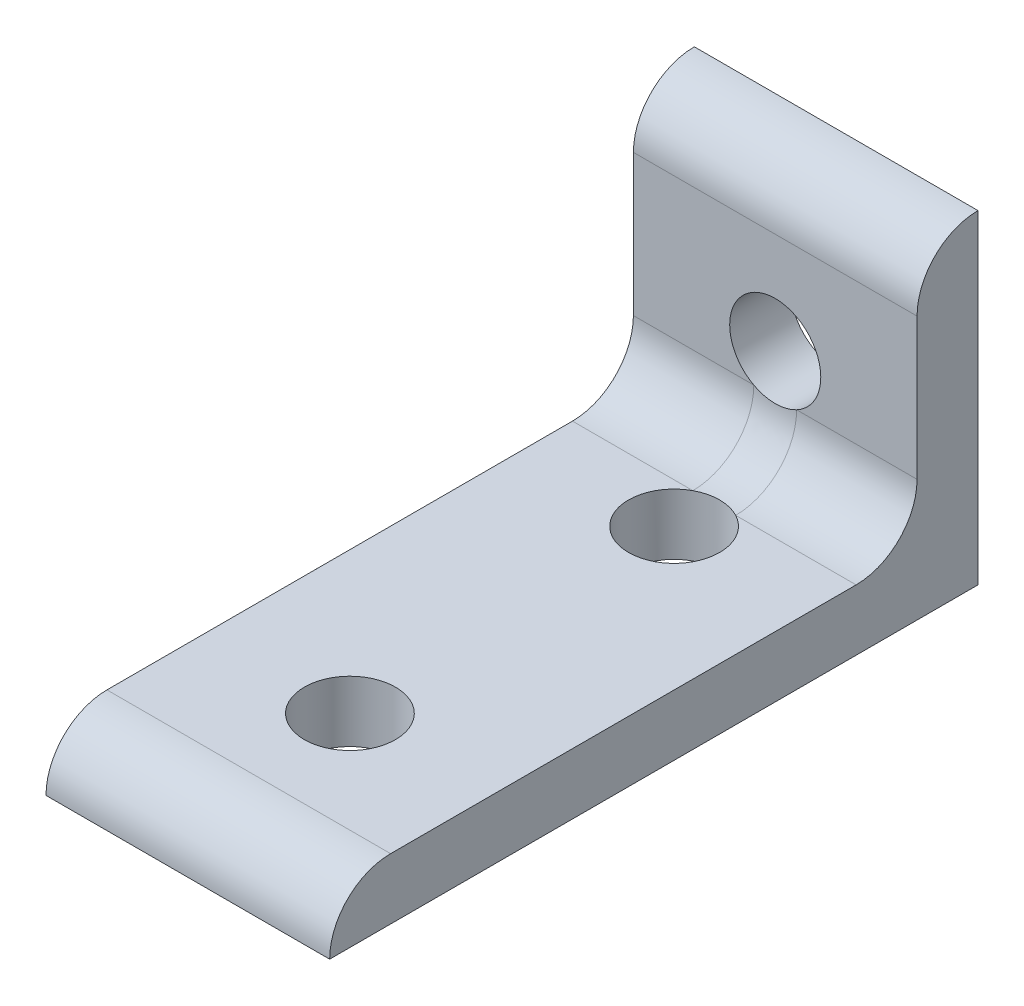
ISO-10303-21;
HEADER;
FILE_DESCRIPTION(('STEP AP214'),'2;1');
FILE_NAME('part.step','',(''),(''),'','','');
FILE_SCHEMA(('AUTOMOTIVE_DESIGN { 1 0 10303 214 1 1 1 1 }'));
ENDSEC;
DATA;
#1=APPLICATION_CONTEXT('core data for automotive mechanical design processes');
#2=APPLICATION_PROTOCOL_DEFINITION('international standard','automotive_design',2000,#1);
#3=PRODUCT_CONTEXT('',#1,'mechanical');
#4=PRODUCT('Part','Part','',(#3));
#5=PRODUCT_RELATED_PRODUCT_CATEGORY('part','',(#4));
#6=PRODUCT_DEFINITION_FORMATION('','',#4);
#7=PRODUCT_DEFINITION_CONTEXT('part definition',#1,'design');
#8=PRODUCT_DEFINITION('design','',#6,#7);
#9=PRODUCT_DEFINITION_SHAPE('','',#8);
#10=(LENGTH_UNIT() NAMED_UNIT(*) SI_UNIT(.MILLI.,.METRE.));
#11=(NAMED_UNIT(*) PLANE_ANGLE_UNIT() SI_UNIT($,.RADIAN.));
#12=(NAMED_UNIT(*) SI_UNIT($,.STERADIAN.) SOLID_ANGLE_UNIT());
#13=UNCERTAINTY_MEASURE_WITH_UNIT(LENGTH_MEASURE(1.E-05),#10,'distance_accuracy_value','');
#14=(GEOMETRIC_REPRESENTATION_CONTEXT(3) GLOBAL_UNCERTAINTY_ASSIGNED_CONTEXT((#13)) GLOBAL_UNIT_ASSIGNED_CONTEXT((#10,
#11,#12)) REPRESENTATION_CONTEXT('',''));
#15=CARTESIAN_POINT('',(0.,0.,0.));
#16=DIRECTION('',(0.,0.,1.));
#17=DIRECTION('',(1.,0.,0.));
#18=AXIS2_PLACEMENT_3D('',#15,#16,#17);
#19=CARTESIAN_POINT('',(22.225,21.8976746849943,23.4239638029782));
#20=DIRECTION('',(1.,0.,0.));
#21=DIRECTION('',(0.,0.,-1.));
#22=AXIS2_PLACEMENT_3D('',#19,#20,#21);
#23=PLANE('',#22);
#24=DIRECTION('',(0.,-1.,0.));
#25=VECTOR('',#24,1.);
#26=CARTESIAN_POINT('',(22.225,72.6976746849943,-22.6008361970212));
#27=LINE('',#26,#25);
#28=CARTESIAN_POINT('',(22.225,47.2976746849943,-22.6008361970215));
#29=VERTEX_POINT('',#28);
#30=CARTESIAN_POINT('',(22.225,21.8976746849943,-22.6008361970218));
#31=VERTEX_POINT('',#30);
#32=EDGE_CURVE('E137',#29,#31,#27,.T.);
#33=ORIENTED_EDGE('',*,*,#32,.F.);
#34=CARTESIAN_POINT('',(22.225,42.5224746849943,-22.6008361970215));
#35=DIRECTION('',(1.,0.,0.));
#36=DIRECTION('',(0.,0.,-1.));
#37=AXIS2_PLACEMENT_3D('',#34,#35,#36);
#38=CIRCLE('',#37,4.7752);
#39=CARTESIAN_POINT('',(22.225,42.5224746849928,-17.8256361970215));
#40=VERTEX_POINT('',#39);
#41=EDGE_CURVE('E117',#29,#40,#38,.T.);
#42=ORIENTED_EDGE('',*,*,#41,.T.);
#43=DIRECTION('',(0.,1.,0.));
#44=VECTOR('',#43,1.);
#45=CARTESIAN_POINT('',(22.225,67.9224746849942,-17.8256361970213));
#46=LINE('',#45,#44);
#47=CARTESIAN_POINT('',(22.225,31.4480746849943,-17.8256361970216));
#48=VERTEX_POINT('',#47);
#49=EDGE_CURVE('E143',#48,#40,#46,.T.);
#50=ORIENTED_EDGE('',*,*,#49,.F.);
#51=CARTESIAN_POINT('',(22.225,31.4480746849943,-13.0504361970216));
#52=DIRECTION('',(1.,0.,0.));
#53=DIRECTION('',(0.,0.,-1.));
#54=AXIS2_PLACEMENT_3D('',#51,#52,#53);
#55=CIRCLE('',#54,4.7752);
#56=CARTESIAN_POINT('',(22.225,26.6728746849943,-13.0504361970216));
#57=VERTEX_POINT('',#56);
#58=EDGE_CURVE('E11',#48,#57,#55,.F.);
#59=ORIENTED_EDGE('',*,*,#58,.T.);
#60=DIRECTION('',(0.,0.,1.));
#61=VECTOR('',#60,1.);
#62=CARTESIAN_POINT('',(22.225,26.6728746849943,23.4239638029782));
#63=LINE('',#62,#61);
#64=CARTESIAN_POINT('',(22.225,26.6728746849943,23.4239638029782));
#65=VERTEX_POINT('',#64);
#66=EDGE_CURVE('E168',#57,#65,#63,.T.);
#67=ORIENTED_EDGE('',*,*,#66,.T.);
#68=CARTESIAN_POINT('',(22.225,21.8976746849943,23.4239638029782));
#69=DIRECTION('',(1.,0.,0.));
#70=DIRECTION('',(0.,0.,-1.));
#71=AXIS2_PLACEMENT_3D('',#68,#69,#70);
#72=CIRCLE('',#71,4.7752);
#73=CARTESIAN_POINT('',(22.225,21.8976746849943,28.1991638029782));
#74=VERTEX_POINT('',#73);
#75=EDGE_CURVE('E161',#65,#74,#72,.T.);
#76=ORIENTED_EDGE('',*,*,#75,.T.);
#77=DIRECTION('',(0.,0.,-1.));
#78=VECTOR('',#77,1.);
#79=CARTESIAN_POINT('',(22.225,21.8976746849943,28.1991638029782));
#80=LINE('',#79,#78);
#81=EDGE_CURVE('E164',#74,#31,#80,.T.);
#82=ORIENTED_EDGE('',*,*,#81,.T.);
#83=EDGE_LOOP('',(#33,#42,#50,#59,#67,#76,#82));
#84=FACE_BOUND('',#83,.T.);
#85=ADVANCED_FACE('F36',(#84),#23,.T.);
#86=CARTESIAN_POINT('',(0.,21.8976746849943,23.4239638029782));
#87=DIRECTION('',(1.,0.,0.));
#88=DIRECTION('',(0.,0.,-1.));
#89=AXIS2_PLACEMENT_3D('',#86,#87,#88);
#90=PLANE('',#89);
#91=CARTESIAN_POINT('',(0.,42.5224746849943,-22.6008361970215));
#92=DIRECTION('',(1.,0.,0.));
#93=DIRECTION('',(0.,0.,-1.));
#94=AXIS2_PLACEMENT_3D('',#91,#92,#93);
#95=CIRCLE('',#94,4.7752);
#96=CARTESIAN_POINT('',(0.,47.2976746849943,-22.6008361970215));
#97=VERTEX_POINT('',#96);
#98=CARTESIAN_POINT('',(0.,42.5224746849928,-17.8256361970215));
#99=VERTEX_POINT('',#98);
#100=EDGE_CURVE('E60',#97,#99,#95,.T.);
#101=ORIENTED_EDGE('',*,*,#100,.F.);
#102=DIRECTION('',(0.,-1.,0.));
#103=VECTOR('',#102,1.);
#104=CARTESIAN_POINT('',(0.,72.6976746849943,-22.6008361970212));
#105=LINE('',#104,#103);
#106=CARTESIAN_POINT('',(0.,21.8976746849943,-22.6008361970218));
#107=VERTEX_POINT('',#106);
#108=EDGE_CURVE('E126',#97,#107,#105,.T.);
#109=ORIENTED_EDGE('',*,*,#108,.T.);
#110=DIRECTION('',(0.,0.,-1.));
#111=VECTOR('',#110,1.);
#112=CARTESIAN_POINT('',(0.,21.8976746849943,28.1991638029782));
#113=LINE('',#112,#111);
#114=CARTESIAN_POINT('',(0.,21.8976746849943,28.1991638029782));
#115=VERTEX_POINT('',#114);
#116=EDGE_CURVE('E173',#115,#107,#113,.T.);
#117=ORIENTED_EDGE('',*,*,#116,.F.);
#118=CARTESIAN_POINT('',(0.,21.8976746849943,23.4239638029782));
#119=DIRECTION('',(1.,0.,0.));
#120=DIRECTION('',(0.,0.,-1.));
#121=AXIS2_PLACEMENT_3D('',#118,#119,#120);
#122=CIRCLE('',#121,4.7752);
#123=CARTESIAN_POINT('',(0.,26.6728746849943,23.4239638029782));
#124=VERTEX_POINT('',#123);
#125=EDGE_CURVE('E158',#124,#115,#122,.T.);
#126=ORIENTED_EDGE('',*,*,#125,.F.);
#127=DIRECTION('',(0.,0.,1.));
#128=VECTOR('',#127,1.);
#129=CARTESIAN_POINT('',(0.,26.6728746849943,23.4239638029782));
#130=LINE('',#129,#128);
#131=CARTESIAN_POINT('',(0.,26.6728746849943,-13.0504361970216));
#132=VERTEX_POINT('',#131);
#133=EDGE_CURVE('E165',#132,#124,#130,.T.);
#134=ORIENTED_EDGE('',*,*,#133,.F.);
#135=CARTESIAN_POINT('',(0.,31.4480746849943,-13.0504361970216));
#136=DIRECTION('',(1.,0.,0.));
#137=DIRECTION('',(0.,0.,-1.));
#138=AXIS2_PLACEMENT_3D('',#135,#136,#137);
#139=CIRCLE('',#138,4.7752);
#140=CARTESIAN_POINT('',(0.,31.4480746849943,-17.8256361970216));
#141=VERTEX_POINT('',#140);
#142=EDGE_CURVE('E52',#132,#141,#139,.T.);
#143=ORIENTED_EDGE('',*,*,#142,.T.);
#144=DIRECTION('',(0.,1.,0.));
#145=VECTOR('',#144,1.);
#146=CARTESIAN_POINT('',(0.,67.9224746849942,-17.8256361970213));
#147=LINE('',#146,#145);
#148=EDGE_CURVE('E129',#141,#99,#147,.T.);
#149=ORIENTED_EDGE('',*,*,#148,.T.);
#150=EDGE_LOOP('',(#101,#109,#117,#126,#134,#143,#149));
#151=FACE_BOUND('',#150,.T.);
#152=ADVANCED_FACE('F125',(#151),#90,.F.);
#153=CARTESIAN_POINT('',(22.225,72.6976746849943,-22.6008361970212));
#154=DIRECTION('',(0.,0.,1.));
#155=DIRECTION('',(0.,1.,0.));
#156=AXIS2_PLACEMENT_3D('',#153,#154,#155);
#157=PLANE('',#156);
#158=CARTESIAN_POINT('',(11.1125,34.5976746849943,-22.6008361970216));
#159=DIRECTION('',(0.,0.,-1.));
#160=DIRECTION('',(0.,1.,0.));
#161=AXIS2_PLACEMENT_3D('',#158,#159,#160);
#162=CIRCLE('',#161,3.5687);
#163=CARTESIAN_POINT('',(11.1125,38.1663746849943,-22.6008361970216));
#164=VERTEX_POINT('',#163);
#165=EDGE_CURVE('E135',#164,#164,#162,.T.);
#166=ORIENTED_EDGE('',*,*,#165,.F.);
#167=EDGE_LOOP('',(#166));
#168=FACE_BOUND('',#167,.T.);
#169=DIRECTION('',(1.,0.,0.));
#170=VECTOR('',#169,1.);
#171=CARTESIAN_POINT('',(0.,47.2976746849943,-22.6008361970215));
#172=LINE('',#171,#170);
#173=EDGE_CURVE('E114',#97,#29,#172,.T.);
#174=ORIENTED_EDGE('',*,*,#173,.T.);
#175=ORIENTED_EDGE('',*,*,#32,.T.);
#176=DIRECTION('',(-1.,0.,0.));
#177=VECTOR('',#176,1.);
#178=CARTESIAN_POINT('',(22.225,21.8976746849943,-22.6008361970218));
#179=LINE('',#178,#177);
#180=EDGE_CURVE('E134',#31,#107,#179,.T.);
#181=ORIENTED_EDGE('',*,*,#180,.T.);
#182=ORIENTED_EDGE('',*,*,#108,.F.);
#183=EDGE_LOOP('',(#174,#175,#181,#182));
#184=FACE_BOUND('',#183,.T.);
#185=ADVANCED_FACE('F132',(#168,#184),#157,.F.);
#186=CARTESIAN_POINT('',(22.225,67.9224746849942,-17.8256361970213));
#187=DIRECTION('',(0.,0.,-1.));
#188=DIRECTION('',(0.,-1.,0.));
#189=AXIS2_PLACEMENT_3D('',#186,#187,#188);
#190=PLANE('',#189);
#191=DIRECTION('',(1.,0.,0.));
#192=VECTOR('',#191,1.);
#193=CARTESIAN_POINT('',(0.,42.5224746849928,-17.8256361970215));
#194=LINE('',#193,#192);
#195=EDGE_CURVE('E121',#99,#40,#194,.T.);
#196=ORIENTED_EDGE('',*,*,#195,.F.);
#197=ORIENTED_EDGE('',*,*,#148,.F.);
#198=DIRECTION('',(-1.,0.,0.));
#199=VECTOR('',#198,1.);
#200=CARTESIAN_POINT('',(22.225,31.4480746849943,-17.8256361970216));
#201=LINE('',#200,#199);
#202=CARTESIAN_POINT('',(9.43451325094603,31.4480746849943,-17.8256361970216));
#203=VERTEX_POINT('',#202);
#204=EDGE_CURVE('E187',#141,#203,#201,.F.);
#205=ORIENTED_EDGE('',*,*,#204,.T.);
#206=CARTESIAN_POINT('',(11.1125,34.5976746849942,-17.8256361970216));
#207=DIRECTION('',(0.,0.,-1.));
#208=DIRECTION('',(0.,1.,0.));
#209=AXIS2_PLACEMENT_3D('',#206,#207,#208);
#210=CIRCLE('',#209,3.5687);
#211=CARTESIAN_POINT('',(12.790486749054,31.4480746849943,-17.8256361970216));
#212=VERTEX_POINT('',#211);
#213=EDGE_CURVE('E195',#203,#212,#210,.T.);
#214=ORIENTED_EDGE('',*,*,#213,.T.);
#215=DIRECTION('',(-1.,0.,0.));
#216=VECTOR('',#215,1.);
#217=CARTESIAN_POINT('',(22.225,31.4480746849943,-17.8256361970216));
#218=LINE('',#217,#216);
#219=EDGE_CURVE('E68',#212,#48,#218,.F.);
#220=ORIENTED_EDGE('',*,*,#219,.T.);
#221=ORIENTED_EDGE('',*,*,#49,.T.);
#222=EDGE_LOOP('',(#196,#197,#205,#214,#220,#221));
#223=FACE_BOUND('',#222,.T.);
#224=ADVANCED_FACE('F228',(#223),#190,.F.);
#225=CARTESIAN_POINT('',(22.225,21.8976746849943,23.4239638029782));
#226=DIRECTION('',(-1.,0.,0.));
#227=DIRECTION('',(0.,0.,1.));
#228=AXIS2_PLACEMENT_3D('',#225,#226,#227);
#229=CYLINDRICAL_SURFACE('',#228,4.7752);
#230=ORIENTED_EDGE('',*,*,#125,.T.);
#231=DIRECTION('',(-1.,0.,0.));
#232=VECTOR('',#231,1.);
#233=CARTESIAN_POINT('',(22.225,21.8976746849943,28.1991638029782));
#234=LINE('',#233,#232);
#235=EDGE_CURVE('E178',#74,#115,#234,.T.);
#236=ORIENTED_EDGE('',*,*,#235,.F.);
#237=ORIENTED_EDGE('',*,*,#75,.F.);
#238=DIRECTION('',(-1.,0.,0.));
#239=VECTOR('',#238,1.);
#240=CARTESIAN_POINT('',(22.225,26.6728746849943,23.4239638029782));
#241=LINE('',#240,#239);
#242=EDGE_CURVE('E170',#65,#124,#241,.T.);
#243=ORIENTED_EDGE('',*,*,#242,.T.);
#244=EDGE_LOOP('',(#230,#236,#237,#243));
#245=FACE_BOUND('',#244,.T.);
#246=ADVANCED_FACE('F233',(#245),#229,.T.);
#247=CARTESIAN_POINT('',(22.225,21.8976746849943,28.1991638029782));
#248=DIRECTION('',(0.,1.,0.));
#249=DIRECTION('',(0.,0.,1.));
#250=AXIS2_PLACEMENT_3D('',#247,#248,#249);
#251=PLANE('',#250);
#252=CARTESIAN_POINT('',(11.1125,21.8976746849943,-9.90083619702176));
#253=DIRECTION('',(0.,1.,0.));
#254=DIRECTION('',(0.,0.,1.));
#255=AXIS2_PLACEMENT_3D('',#252,#253,#254);
#256=CIRCLE('',#255,3.5687);
#257=CARTESIAN_POINT('',(11.1125,21.8976746849943,-6.33213619702176));
#258=VERTEX_POINT('',#257);
#259=EDGE_CURVE('E148',#258,#258,#256,.T.);
#260=ORIENTED_EDGE('',*,*,#259,.T.);
#261=EDGE_LOOP('',(#260));
#262=FACE_BOUND('',#261,.T.);
#263=CARTESIAN_POINT('',(11.1125,21.8976746849943,15.4991638029782));
#264=DIRECTION('',(0.,1.,0.));
#265=DIRECTION('',(0.,0.,1.));
#266=AXIS2_PLACEMENT_3D('',#263,#264,#265);
#267=CIRCLE('',#266,3.5687);
#268=CARTESIAN_POINT('',(11.1125,21.8976746849943,19.0678638029782));
#269=VERTEX_POINT('',#268);
#270=EDGE_CURVE('E155',#269,#269,#267,.T.);
#271=ORIENTED_EDGE('',*,*,#270,.T.);
#272=EDGE_LOOP('',(#271));
#273=FACE_BOUND('',#272,.T.);
#274=ORIENTED_EDGE('',*,*,#116,.T.);
#275=ORIENTED_EDGE('',*,*,#180,.F.);
#276=ORIENTED_EDGE('',*,*,#81,.F.);
#277=ORIENTED_EDGE('',*,*,#235,.T.);
#278=EDGE_LOOP('',(#274,#275,#276,#277));
#279=FACE_BOUND('',#278,.T.);
#280=ADVANCED_FACE('F268',(#262,#273,#279),#251,.F.);
#281=CARTESIAN_POINT('',(22.225,26.6728746849943,23.4239638029782));
#282=DIRECTION('',(0.,-1.,0.));
#283=DIRECTION('',(0.,0.,-1.));
#284=AXIS2_PLACEMENT_3D('',#281,#282,#283);
#285=PLANE('',#284);
#286=ORIENTED_EDGE('',*,*,#66,.F.);
#287=DIRECTION('',(-1.,0.,0.));
#288=VECTOR('',#287,1.);
#289=CARTESIAN_POINT('',(0.,26.6728746849943,-13.0504361970216));
#290=LINE('',#289,#288);
#291=CARTESIAN_POINT('',(12.7904867490539,26.6728746849943,-13.0504361970217));
#292=VERTEX_POINT('',#291);
#293=EDGE_CURVE('E183',#57,#292,#290,.T.);
#294=ORIENTED_EDGE('',*,*,#293,.T.);
#295=CARTESIAN_POINT('',(11.1125,26.6728746849943,-9.90083619702176));
#296=DIRECTION('',(0.,1.,0.));
#297=DIRECTION('',(0.,0.,1.));
#298=AXIS2_PLACEMENT_3D('',#295,#296,#297);
#299=CIRCLE('',#298,3.5687);
#300=CARTESIAN_POINT('',(9.43451325094603,26.6728746849943,-13.0504361970216));
#301=VERTEX_POINT('',#300);
#302=EDGE_CURVE('E147',#301,#292,#299,.T.);
#303=ORIENTED_EDGE('',*,*,#302,.F.);
#304=DIRECTION('',(-1.,0.,0.));
#305=VECTOR('',#304,1.);
#306=CARTESIAN_POINT('',(0.,26.6728746849943,-13.0504361970216));
#307=LINE('',#306,#305);
#308=EDGE_CURVE('E181',#301,#132,#307,.T.);
#309=ORIENTED_EDGE('',*,*,#308,.T.);
#310=ORIENTED_EDGE('',*,*,#133,.T.);
#311=ORIENTED_EDGE('',*,*,#242,.F.);
#312=EDGE_LOOP('',(#286,#294,#303,#309,#310,#311));
#313=FACE_BOUND('',#312,.T.);
#314=CARTESIAN_POINT('',(11.1125,26.6728746849943,15.4991638029782));
#315=DIRECTION('',(0.,1.,0.));
#316=DIRECTION('',(0.,0.,1.));
#317=AXIS2_PLACEMENT_3D('',#314,#315,#316);
#318=CIRCLE('',#317,3.5687);
#319=CARTESIAN_POINT('',(11.1125,26.6728746849943,19.0678638029782));
#320=VERTEX_POINT('',#319);
#321=EDGE_CURVE('E151',#320,#320,#318,.T.);
#322=ORIENTED_EDGE('',*,*,#321,.F.);
#323=EDGE_LOOP('',(#322));
#324=FACE_BOUND('',#323,.T.);
#325=ADVANCED_FACE('F207',(#313,#324),#285,.F.);
#326=CARTESIAN_POINT('',(11.1125,21.8976746849943,15.4991638029782));
#327=DIRECTION('',(0.,1.,0.));
#328=DIRECTION('',(0.,0.,1.));
#329=AXIS2_PLACEMENT_3D('',#326,#327,#328);
#330=CYLINDRICAL_SURFACE('',#329,3.5687);
#331=ORIENTED_EDGE('',*,*,#270,.F.);
#332=EDGE_LOOP('',(#331));
#333=FACE_BOUND('',#332,.T.);
#334=ORIENTED_EDGE('',*,*,#321,.T.);
#335=EDGE_LOOP('',(#334));
#336=FACE_BOUND('',#335,.T.);
#337=ADVANCED_FACE('F217',(#333,#336),#330,.F.);
#338=CARTESIAN_POINT('',(11.1125,21.8976746849943,-9.90083619702176));
#339=DIRECTION('',(0.,1.,0.));
#340=DIRECTION('',(0.,0.,1.));
#341=AXIS2_PLACEMENT_3D('',#338,#339,#340);
#342=CYLINDRICAL_SURFACE('',#341,3.5687);
#343=ORIENTED_EDGE('',*,*,#259,.F.);
#344=EDGE_LOOP('',(#343));
#345=FACE_BOUND('',#344,.T.);
#346=EDGE_CURVE('E152',#292,#301,#299,.T.);
#347=ORIENTED_EDGE('',*,*,#346,.T.);
#348=ORIENTED_EDGE('',*,*,#302,.T.);
#349=EDGE_LOOP('',(#347,#348));
#350=FACE_BOUND('',#349,.T.);
#351=ADVANCED_FACE('F211',(#345,#350),#342,.F.);
#352=CARTESIAN_POINT('',(11.1125,34.5976746849943,-22.6008361970216));
#353=DIRECTION('',(0.,0.,1.));
#354=DIRECTION('',(0.,1.,0.));
#355=AXIS2_PLACEMENT_3D('',#352,#353,#354);
#356=CYLINDRICAL_SURFACE('',#355,3.5687);
#357=ORIENTED_EDGE('',*,*,#165,.T.);
#358=EDGE_LOOP('',(#357));
#359=FACE_BOUND('',#358,.T.);
#360=EDGE_CURVE('E140',#212,#203,#210,.T.);
#361=ORIENTED_EDGE('',*,*,#360,.F.);
#362=ORIENTED_EDGE('',*,*,#213,.F.);
#363=EDGE_LOOP('',(#361,#362));
#364=FACE_BOUND('',#363,.T.);
#365=ADVANCED_FACE('F216',(#359,#364),#356,.F.);
#366=CARTESIAN_POINT('',(22.225,31.4480746849943,-13.0504361970216));
#367=DIRECTION('',(1.,0.,0.));
#368=DIRECTION('',(0.,0.,-1.));
#369=AXIS2_PLACEMENT_3D('',#366,#367,#368);
#370=CYLINDRICAL_SURFACE('',#369,4.7752);
#371=ORIENTED_EDGE('',*,*,#142,.F.);
#372=ORIENTED_EDGE('',*,*,#308,.F.);
#373=CARTESIAN_POINT('',(9.43451325094603,31.4480746849943,-13.0504361970217));
#374=DIRECTION('',(-1.,0.,0.));
#375=DIRECTION('',(0.,0.,1.));
#376=AXIS2_PLACEMENT_3D('',#373,#374,#375);
#377=CIRCLE('',#376,4.7752);
#378=EDGE_CURVE('E192',#203,#301,#377,.T.);
#379=ORIENTED_EDGE('',*,*,#378,.F.);
#380=ORIENTED_EDGE('',*,*,#204,.F.);
#381=EDGE_LOOP('',(#371,#372,#379,#380));
#382=FACE_BOUND('',#381,.T.);
#383=ADVANCED_FACE('F238',(#382),#370,.F.);
#384=CARTESIAN_POINT('',(8.74865551605279,31.9241266779982,-17.8256361970216));
#385=CARTESIAN_POINT('',(9.46326186164712,26.0908892349341,-18.407621703914));
#386=CARTESIAN_POINT('',(8.74865556687603,26.6728746849943,-12.5743842489537));
#387=CARTESIAN_POINT('',(8.78451098262395,31.892444234666,-17.8256361970216));
#388=CARTESIAN_POINT('',(9.40267034387381,26.1339873043522,-18.3645235978683));
#389=CARTESIAN_POINT('',(8.7845110008308,26.6728746849943,-12.6060666634713));
#390=CARTESIAN_POINT('',(8.82346232349616,31.8592711602678,-17.8256361970216));
#391=CARTESIAN_POINT('',(9.35617119951118,26.1796112733825,-18.3188996139939));
#392=CARTESIAN_POINT('',(8.82346232836531,26.6728746849943,-12.639239726065));
#393=CARTESIAN_POINT('',(8.90791494847003,31.790824970103,-17.8256361970216));
#394=CARTESIAN_POINT('',(9.29129393828677,26.2718237480344,-18.2266871287278));
#395=CARTESIAN_POINT('',(8.90791494360907,26.6728746849943,-12.7076859076031));
#396=CARTESIAN_POINT('',(8.95341072636571,31.7555536342083,-17.8256361970216));
#397=CARTESIAN_POINT('',(9.27239225355385,26.318380070089,-18.1801308105429));
#398=CARTESIAN_POINT('',(8.95341072509814,26.6728746849943,-12.7429572466631));
#399=CARTESIAN_POINT('',(9.05121078955535,31.6838523450431,-17.8256361970216));
#400=CARTESIAN_POINT('',(9.2604649843854,26.4093739351034,-18.0891369482696));
#401=CARTESIAN_POINT('',(9.05121079082131,26.6728746849943,-12.8146585381155));
#402=CARTESIAN_POINT('',(9.10349259396244,31.6474265049695,-17.8256361970216));
#403=CARTESIAN_POINT('',(9.26690128340909,26.4538606215776,-18.0446502607707));
#404=CARTESIAN_POINT('',(9.10349259418352,26.6728746849943,-12.851084377324));
#405=CARTESIAN_POINT('',(9.21524107955582,31.5743508894693,-17.8256361970216));
#406=CARTESIAN_POINT('',(9.3024697409706,26.5389238885445,-17.9595869931452));
#407=CARTESIAN_POINT('',(9.21524107933547,26.6728746849943,-12.9241599922696));
#408=CARTESIAN_POINT('',(9.27470940716051,31.5377010645609,-17.8256361970217));
#409=CARTESIAN_POINT('',(9.33124009098332,26.5795953355439,-17.9189155464887));
#410=CARTESIAN_POINT('',(9.27470940754399,26.6728746849943,-12.9608098174887));
#411=CARTESIAN_POINT('',(9.40083848892409,31.4654056958782,-17.8256361970217));
#412=CARTESIAN_POINT('',(9.40832301832199,26.6557552091104,-17.8427556728862));
#413=CARTESIAN_POINT('',(9.40083848853598,26.6728746849943,-13.0331051861013));
#414=CARTESIAN_POINT('',(9.46749188628268,31.4297591711236,-17.8256361970217));
#415=CARTESIAN_POINT('',(9.45635714504307,26.6913703671913,-17.8071405144381));
#416=CARTESIAN_POINT('',(9.46749188452118,26.6728746849943,-13.0687517104758));
#417=CARTESIAN_POINT('',(9.60788966062648,31.3607184312292,-17.8256361970217));
#418=CARTESIAN_POINT('',(9.56884796640732,26.7568585525311,-17.7416523298718));
#419=CARTESIAN_POINT('',(9.60788966240013,26.6728746849943,-13.1377924512093));
#420=CARTESIAN_POINT('',(9.68163429811137,31.3273242989086,-17.8256361970217));
#421=CARTESIAN_POINT('',(9.63316293613969,26.7868597424096,-17.7116511411138));
#422=CARTESIAN_POINT('',(9.68163430479379,26.6728746849943,-13.171186584749));
#423=CARTESIAN_POINT('',(9.83582837660476,31.2641080226699,-17.8256361970217));
#424=CARTESIAN_POINT('',(9.77525541572204,26.8409588678759,-17.6575520126404));
#425=CARTESIAN_POINT('',(9.83582836989383,26.6728746849943,-13.2344028576935));
#426=CARTESIAN_POINT('',(9.91628205253613,31.234288164316,-17.8256361970217));
#427=CARTESIAN_POINT('',(9.85301115216184,26.865173133908,-17.6333377425373));
#428=CARTESIAN_POINT('',(9.91628202750833,26.6728746849943,-13.2642227115303));
#429=CARTESIAN_POINT('',(10.0830887797594,31.1795382521341,-17.8256361970217));
#430=CARTESIAN_POINT('',(10.0190651635828,26.9077818564935,-17.5907290310414));
#431=CARTESIAN_POINT('',(10.0830888047981,26.6728746849943,-13.3189726360551));
#432=CARTESIAN_POINT('',(10.1694420672006,31.1546083941974,-17.8256361970217));
#433=CARTESIAN_POINT('',(10.1074331262245,26.926277560901,-17.572233341618));
#434=CARTESIAN_POINT('',(10.1694421606262,26.6728746849943,-13.3439025108524));
#435=CARTESIAN_POINT('',(10.4142759255803,31.0942781333747,-17.8256361970217));
#436=CARTESIAN_POINT('',(10.3611753326789,26.9694571719404,-17.5290537428312));
#437=CARTESIAN_POINT('',(10.4142760764016,26.6728746849943,-13.4042327858266));
#438=CARTESIAN_POINT('',(10.5778239628121,31.0652599867166,-17.8256361970217));
#439=CARTESIAN_POINT('',(10.5361018092549,26.9887478761766,-17.5097630145729));
#440=CARTESIAN_POINT('',(10.5778240032138,26.6728746849943,-13.433250905262));
#441=CARTESIAN_POINT('',(10.9118628430827,31.0306673455199,-17.8256361970217));
#442=CARTESIAN_POINT('',(10.8949566905659,27.0113421447748,-17.487168728557));
#443=CARTESIAN_POINT('',(10.9118628026692,26.6728746849943,-13.4678435265329));
#444=CARTESIAN_POINT('',(11.0823529237473,31.0250902836583,-17.8256361970217));
#445=CARTESIAN_POINT('',(11.0802301142627,27.0148265405557,-17.4836843391349));
#446=CARTESIAN_POINT('',(11.0823529129229,26.6728746849943,-13.4734205956876));
#447=CARTESIAN_POINT('',(11.4206088311865,31.03827366713,-17.8256361970217));
#448=CARTESIAN_POINT('',(11.4453697526573,27.0063738365576,-17.4921370477878));
#449=CARTESIAN_POINT('',(11.4206088420114,26.6728746849943,-13.4602372175549));
#450=CARTESIAN_POINT('',(11.5883756075716,31.0570254360843,-17.8256361970217));
#451=CARTESIAN_POINT('',(11.6266802171009,26.9943751507521,-17.5041357318931));
#452=CARTESIAN_POINT('',(11.5883756104703,26.6728746849943,-13.4414854466498));
#453=CARTESIAN_POINT('',(11.9122913535613,31.1158491140461,-17.8256361970217));
#454=CARTESIAN_POINT('',(11.9700938217338,26.954260345582,-17.5442505357973));
#455=CARTESIAN_POINT('',(11.9122913506678,26.6728746849943,-13.3826617672505));
#456=CARTESIAN_POINT('',(12.0684371051551,31.1559269036481,-17.8256361970217));
#457=CARTESIAN_POINT('',(12.1333039800741,26.9258250374669,-17.572685844364));
#458=CARTESIAN_POINT('',(12.0684371043985,26.6728746849943,-13.3425839781624));
#459=CARTESIAN_POINT('',(12.3626197655141,31.2515073183371,-17.8256361970217));
#460=CARTESIAN_POINT('',(12.426826617637,26.8516666584421,-17.6468442237582));
#461=CARTESIAN_POINT('',(12.3626197662861,26.6728746849943,-13.2470035638799));
#462=CARTESIAN_POINT('',(12.5006322741423,31.3070304199518,-17.8256361970217));
#463=CARTESIAN_POINT('',(12.5574898912569,26.8053688950582,-17.6931419870509));
#464=CARTESIAN_POINT('',(12.5006322743025,26.6728746849943,-13.191480462157));
#465=CARTESIAN_POINT('',(12.7547041241498,31.4261567740003,-17.8256361970217));
#466=CARTESIAN_POINT('',(12.7710681514613,26.6955702334573,-17.8029406484574));
#467=CARTESIAN_POINT('',(12.7547041240027,26.6728746849943,-13.0723541079169));
#468=CARTESIAN_POINT('',(12.8707783769405,31.489754488618,-17.8256361970216));
#469=CARTESIAN_POINT('',(12.8534097328248,26.6313782374989,-17.8671326443117));
#470=CARTESIAN_POINT('',(12.8707783770972,26.6728746849943,-13.0087563932158));
#471=CARTESIAN_POINT('',(13.0281141178482,31.5860572414799,-17.8256361970216));
#472=CARTESIAN_POINT('',(12.9293233844646,26.525629608944,-17.9728812731808));
#473=CARTESIAN_POINT('',(13.0281141177638,26.6728746849943,-12.9124536406309));
#474=CARTESIAN_POINT('',(13.0777968720471,31.618335719013,-17.8256361970216));
#475=CARTESIAN_POINT('',(12.9466504050504,26.4882763329176,-18.0102345493954));
#476=CARTESIAN_POINT('',(13.0777968717658,26.6728746849943,-12.8801751632575));
#477=CARTESIAN_POINT('',(13.1716588356032,31.6824199399343,-17.8256361970216));
#478=CARTESIAN_POINT('',(12.9634626281003,26.4111518662624,-18.0873590154511));
#479=CARTESIAN_POINT('',(13.1716588358857,26.6728746849943,-12.8160909418263));
#480=CARTESIAN_POINT('',(13.2158389482887,31.7142257601583,-17.8256361970216));
#481=CARTESIAN_POINT('',(12.9626770175354,26.3713266030679,-18.1271842778428));
#482=CARTESIAN_POINT('',(13.2158389493318,26.6728746849943,-12.7842851209329));
#483=CARTESIAN_POINT('',(13.2989989213918,31.7767595029757,-17.8256361970216));
#484=CARTESIAN_POINT('',(12.9413648835307,26.2905749272032,-18.2079359559514));
#485=CARTESIAN_POINT('',(13.2989989203313,26.6728746849943,-12.7217513799783));
#486=CARTESIAN_POINT('',(13.3379655963989,31.8074845528746,-17.8256361970216));
#487=CARTESIAN_POINT('',(12.9204673819566,26.2496274897844,-18.2488833964893));
#488=CARTESIAN_POINT('',(13.3379655924651,26.6728746849943,-12.6910263326195));
#489=CARTESIAN_POINT('',(13.4108694036566,31.8672311912948,-17.8256361970216));
#490=CARTESIAN_POINT('',(12.8574816743529,26.1687329335823,-18.3297779441154));
#491=CARTESIAN_POINT('',(13.4108694075807,26.6728746849943,-12.6312796872508));
#492=CARTESIAN_POINT('',(13.4448034696815,31.8962517348592,-17.8256361970216));
#493=CARTESIAN_POINT('',(12.8150382578475,26.128814663671,-18.3696962020783));
#494=CARTESIAN_POINT('',(13.4448034843452,26.6728746849943,-12.6022591341904));
#495=CARTESIAN_POINT('',(13.4763479401889,31.9241297338732,-17.8256361970216));
#496=CARTESIAN_POINT('',(12.761732269418,26.0908849345209,-18.4076259018156));
#497=CARTESIAN_POINT('',(13.4763479810384,26.6728746849943,-12.5743811120252));
#498=(BOUNDED_SURFACE() B_SPLINE_SURFACE(3,2,((#384,#385,#386),(#387,#388,#389),(#390,#391,
#392),(#393,#394,#395),(#396,#397,#398),(#399,#400,#401),(#402,#403,#404),(#405,#406,#407),
(#408,#409,#410),(#411,#412,#413),(#414,#415,#416),(#417,#418,#419),(#420,#421,#422),(#423,#424,
#425),(#426,#427,#428),(#429,#430,#431),(#432,#433,#434),(#435,#436,#437),(#438,#439,#440),
(#441,#442,#443),(#444,#445,#446),(#447,#448,#449),(#450,#451,#452),(#453,#454,#455),(#456,#457,
#458),(#459,#460,#461),(#462,#463,#464),(#465,#466,#467),(#468,#469,#470),(#471,#472,#473),
(#474,#475,#476),(#477,#478,#479),(#480,#481,#482),(#483,#484,#485),(#486,#487,#488),(#489,#490,
#491),(#492,#493,#494),(#495,#496,#497)),.UNSPECIFIED.,.F.,.F.,
.F.) B_SPLINE_SURFACE_WITH_KNOTS((4,2,2,2,2,2,2,2,2,2,2,2,2,2,2,2,2,2,4),(3,3),(0.,
0.257813805202279,0.51541195215838,0.772177521952595,1.02900202815366,1.28556602529158,
1.54213945101873,1.79887607674279,2.05562298513611,2.50693828456191,2.95820415357895,
3.40930913209789,3.86053856614511,4.3123690894573,4.76389139077508,4.99001938803257,
5.21611021444708,5.44276245780254,5.66955223156539),(0.,1.),
.UNSPECIFIED.) GEOMETRIC_REPRESENTATION_ITEM() RATIONAL_B_SPLINE_SURFACE(((1.,0.628759193473815,
1.),(1.,0.634566617851589,1.),(1.,0.640503648336097,1.),(1.,0.652461819351013,1.),(1.,
0.658482885370132,1.),(1.,0.670424979694853,1.),(1.,0.676346268432083,1.),(1.,0.687945478602592,
1.),(1.,0.693623343862853,1.),(1.,0.704572680551964,1.),(1.,0.709844558363063,1.),(1.,
0.719845519880293,1.),(1.,0.724574583631912,1.),(1.,0.733365339608893,1.),(1.,0.737426605422427,
1.),(1.,0.744771268346097,1.),(1.,0.748054634294962,1.),(1.,0.755913089631228,1.),(1.,
0.759581458417743,1.),(1.,0.763939522270521,1.),(1.,0.764629543532682,1.),(1.,0.762979275299727,
1.),(1.,0.760640066118144,1.),(1.,0.753116469088791,1.),(1.,0.747931296461619,1.),(1.,
0.735123549167711,1.),(1.,0.727497736803652,1.),(1.,0.710442191066296,1.),(1.,0.701013691809526,
1.),(1.,0.686101620157656,1.),(1.,0.680998260152571,1.),(1.,0.670648455908869,1.),(1.,
0.665402035328286,1.),(1.,0.654865342580214,1.),(1.,0.649574993872304,1.),(1.,0.639075824946947,
1.),(1.,0.633867056148084,1.),(1.,0.628758626421662,1.))) REPRESENTATION_ITEM('') SURFACE());
#499=ORIENTED_EDGE('',*,*,#378,.T.);
#500=ORIENTED_EDGE('',*,*,#346,.F.);
#501=CARTESIAN_POINT('',(12.7904867490539,31.4480746849943,-13.0504361970217));
#502=DIRECTION('',(-1.,0.,0.));
#503=DIRECTION('',(0.,0.,1.));
#504=AXIS2_PLACEMENT_3D('',#501,#502,#503);
#505=CIRCLE('',#504,4.7752);
#506=EDGE_CURVE('E190',#212,#292,#505,.T.);
#507=ORIENTED_EDGE('',*,*,#506,.F.);
#508=ORIENTED_EDGE('',*,*,#360,.T.);
#509=EDGE_LOOP('',(#499,#500,#507,#508));
#510=FACE_BOUND('',#509,.T.);
#511=ADVANCED_FACE('F38',(#510),#498,.F.);
#512=CARTESIAN_POINT('',(22.225,31.4480746849943,-13.0504361970216));
#513=DIRECTION('',(1.,0.,0.));
#514=DIRECTION('',(0.,0.,-1.));
#515=AXIS2_PLACEMENT_3D('',#512,#513,#514);
#516=CYLINDRICAL_SURFACE('',#515,4.7752);
#517=ORIENTED_EDGE('',*,*,#58,.F.);
#518=ORIENTED_EDGE('',*,*,#219,.F.);
#519=ORIENTED_EDGE('',*,*,#506,.T.);
#520=ORIENTED_EDGE('',*,*,#293,.F.);
#521=EDGE_LOOP('',(#517,#518,#519,#520));
#522=FACE_BOUND('',#521,.T.);
#523=ADVANCED_FACE('F202',(#522),#516,.F.);
#524=CARTESIAN_POINT('',(0.,42.5224746849943,-22.6008361970215));
#525=DIRECTION('',(1.,0.,0.));
#526=DIRECTION('',(0.,0.,-1.));
#527=AXIS2_PLACEMENT_3D('',#524,#525,#526);
#528=CYLINDRICAL_SURFACE('',#527,4.7752);
#529=ORIENTED_EDGE('',*,*,#41,.F.);
#530=ORIENTED_EDGE('',*,*,#173,.F.);
#531=ORIENTED_EDGE('',*,*,#100,.T.);
#532=ORIENTED_EDGE('',*,*,#195,.T.);
#533=EDGE_LOOP('',(#529,#530,#531,#532));
#534=FACE_BOUND('',#533,.T.);
#535=ADVANCED_FACE('F115',(#534),#528,.T.);
#536=CLOSED_SHELL('',(#85,#152,#185,#224,#246,#280,#325,#337,#351,#365,#383,#511,#523,#535));
#537=MANIFOLD_SOLID_BREP('B2',#536);
#538=ADVANCED_BREP_SHAPE_REPRESENTATION('',(#18,#537),#14);
#539=SHAPE_DEFINITION_REPRESENTATION(#9,#538);
ENDSEC;
END-ISO-10303-21;
